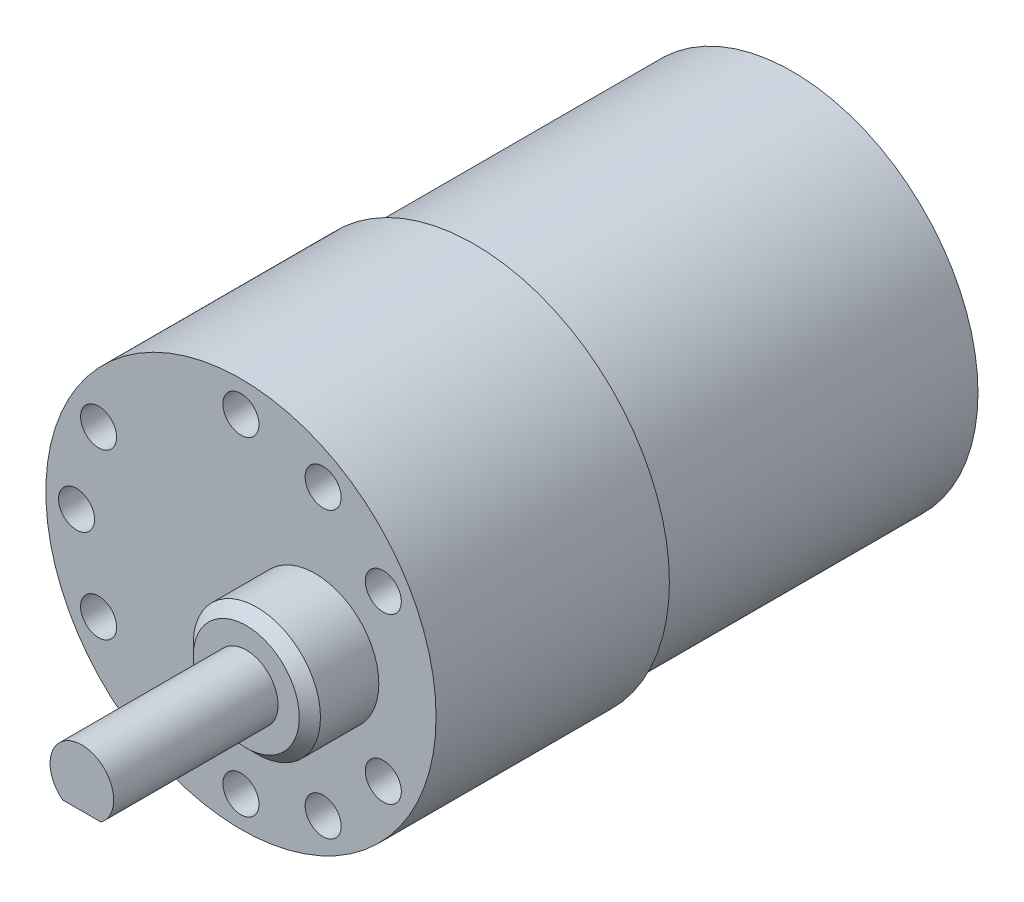
ISO-10303-21;
HEADER;
FILE_DESCRIPTION(('STEP AP214'),'2;1');
FILE_NAME('part.step','',(''),(''),'','','');
FILE_SCHEMA(('AUTOMOTIVE_DESIGN { 1 0 10303 214 1 1 1 1 }'));
ENDSEC;
DATA;
#1=APPLICATION_CONTEXT('core data for automotive mechanical design processes');
#2=APPLICATION_PROTOCOL_DEFINITION('international standard','automotive_design',2000,#1);
#3=PRODUCT_CONTEXT('',#1,'mechanical');
#4=PRODUCT('Part','Part','',(#3));
#5=PRODUCT_RELATED_PRODUCT_CATEGORY('part','',(#4));
#6=PRODUCT_DEFINITION_FORMATION('','',#4);
#7=PRODUCT_DEFINITION_CONTEXT('part definition',#1,'design');
#8=PRODUCT_DEFINITION('design','',#6,#7);
#9=PRODUCT_DEFINITION_SHAPE('','',#8);
#10=(LENGTH_UNIT() NAMED_UNIT(*) SI_UNIT(.MILLI.,.METRE.));
#11=(NAMED_UNIT(*) PLANE_ANGLE_UNIT() SI_UNIT($,.RADIAN.));
#12=(NAMED_UNIT(*) SI_UNIT($,.STERADIAN.) SOLID_ANGLE_UNIT());
#13=UNCERTAINTY_MEASURE_WITH_UNIT(LENGTH_MEASURE(1.E-05),#10,'distance_accuracy_value','');
#14=(GEOMETRIC_REPRESENTATION_CONTEXT(3) GLOBAL_UNCERTAINTY_ASSIGNED_CONTEXT((#13)) GLOBAL_UNIT_ASSIGNED_CONTEXT((#10,
#11,#12)) REPRESENTATION_CONTEXT('',''));
#15=CARTESIAN_POINT('',(0.,0.,0.));
#16=DIRECTION('',(0.,0.,1.));
#17=DIRECTION('',(1.,0.,0.));
#18=AXIS2_PLACEMENT_3D('',#15,#16,#17);
#19=CARTESIAN_POINT('',(7.,0.,28.5));
#20=DIRECTION('',(0.,0.,1.));
#21=DIRECTION('',(1.,0.,0.));
#22=AXIS2_PLACEMENT_3D('',#19,#20,#21);
#23=PLANE('',#22);
#24=CARTESIAN_POINT('',(7.,0.,28.5));
#25=DIRECTION('',(0.,0.,1.));
#26=DIRECTION('',(1.,0.,0.));
#27=AXIS2_PLACEMENT_3D('',#24,#25,#26);
#28=CIRCLE('',#27,5.00000000000005);
#29=CARTESIAN_POINT('',(12.0000000000001,0.,28.5));
#30=VERTEX_POINT('',#29);
#31=EDGE_CURVE('E43',#30,#30,#28,.T.);
#32=ORIENTED_EDGE('',*,*,#31,.T.);
#33=EDGE_LOOP('',(#32));
#34=FACE_BOUND('',#33,.T.);
#35=CARTESIAN_POINT('',(7.,0.,28.5));
#36=DIRECTION('',(0.,0.,1.));
#37=DIRECTION('',(1.,0.,0.));
#38=AXIS2_PLACEMENT_3D('',#35,#36,#37);
#39=CIRCLE('',#38,3.);
#40=CARTESIAN_POINT('',(10.,0.,28.5));
#41=VERTEX_POINT('',#40);
#42=EDGE_CURVE('E69',#41,#41,#39,.T.);
#43=ORIENTED_EDGE('',*,*,#42,.F.);
#44=EDGE_LOOP('',(#43));
#45=FACE_BOUND('',#44,.T.);
#46=ADVANCED_FACE('F34',(#34,#45),#23,.T.);
#47=CARTESIAN_POINT('',(0.,0.,22.));
#48=DIRECTION('',(0.,0.,1.));
#49=DIRECTION('',(1.,0.,0.));
#50=AXIS2_PLACEMENT_3D('',#47,#48,#49);
#51=PLANE('',#50);
#52=CARTESIAN_POINT('',(7.74999999999987,-13.4233937586589,22.));
#53=DIRECTION('',(0.,0.,1.));
#54=DIRECTION('',(1.,0.,0.));
#55=AXIS2_PLACEMENT_3D('',#52,#53,#54);
#56=CIRCLE('',#55,1.7);
#57=CARTESIAN_POINT('',(9.44999999999987,-13.4233937586589,22.));
#58=VERTEX_POINT('',#57);
#59=EDGE_CURVE('E408',#58,#58,#56,.T.);
#60=ORIENTED_EDGE('',*,*,#59,.F.);
#61=EDGE_LOOP('',(#60));
#62=FACE_BOUND('',#61,.T.);
#63=CARTESIAN_POINT('',(7.75000000000006,13.4233937586588,22.));
#64=DIRECTION('',(0.,0.,1.));
#65=DIRECTION('',(1.,0.,0.));
#66=AXIS2_PLACEMENT_3D('',#63,#64,#65);
#67=CIRCLE('',#66,1.7);
#68=CARTESIAN_POINT('',(9.45000000000006,13.4233937586588,22.));
#69=VERTEX_POINT('',#68);
#70=EDGE_CURVE('E407',#69,#69,#67,.T.);
#71=ORIENTED_EDGE('',*,*,#70,.F.);
#72=EDGE_LOOP('',(#71));
#73=FACE_BOUND('',#72,.T.);
#74=CARTESIAN_POINT('',(-13.4233937586585,7.74999999999942,22.));
#75=DIRECTION('',(0.,0.,1.));
#76=DIRECTION('',(1.,0.,0.));
#77=AXIS2_PLACEMENT_3D('',#74,#75,#76);
#78=CIRCLE('',#77,1.70000000000067);
#79=CARTESIAN_POINT('',(-11.7233937586578,7.74999999999942,22.));
#80=VERTEX_POINT('',#79);
#81=EDGE_CURVE('E417',#80,#80,#78,.T.);
#82=ORIENTED_EDGE('',*,*,#81,.F.);
#83=EDGE_LOOP('',(#82));
#84=FACE_BOUND('',#83,.T.);
#85=CARTESIAN_POINT('',(-13.4233937586578,-7.75000000000058,22.));
#86=DIRECTION('',(0.,0.,1.));
#87=DIRECTION('',(1.,0.,0.));
#88=AXIS2_PLACEMENT_3D('',#85,#86,#87);
#89=CIRCLE('',#88,1.70000000000126);
#90=CARTESIAN_POINT('',(-11.7233937586566,-7.75000000000058,22.));
#91=VERTEX_POINT('',#90);
#92=EDGE_CURVE('E422',#91,#91,#89,.T.);
#93=ORIENTED_EDGE('',*,*,#92,.F.);
#94=EDGE_LOOP('',(#93));
#95=FACE_BOUND('',#94,.T.);
#96=CARTESIAN_POINT('',(1.31781308343643E-12,-15.5,22.));
#97=DIRECTION('',(0.,0.,1.));
#98=DIRECTION('',(1.,0.,0.));
#99=AXIS2_PLACEMENT_3D('',#96,#97,#98);
#100=CIRCLE('',#99,1.70000000000136);
#101=CARTESIAN_POINT('',(1.70000000000268,-15.5,22.));
#102=VERTEX_POINT('',#101);
#103=EDGE_CURVE('E428',#102,#102,#100,.T.);
#104=ORIENTED_EDGE('',*,*,#103,.F.);
#105=EDGE_LOOP('',(#104));
#106=FACE_BOUND('',#105,.T.);
#107=CARTESIAN_POINT('',(13.4233937586598,-7.74999999999943,22.));
#108=DIRECTION('',(0.,0.,1.));
#109=DIRECTION('',(1.,0.,0.));
#110=AXIS2_PLACEMENT_3D('',#107,#108,#109);
#111=CIRCLE('',#110,1.70000000000085);
#112=CARTESIAN_POINT('',(15.1233937586606,-7.74999999999943,22.));
#113=VERTEX_POINT('',#112);
#114=EDGE_CURVE('E434',#113,#113,#111,.T.);
#115=ORIENTED_EDGE('',*,*,#114,.F.);
#116=EDGE_LOOP('',(#115));
#117=FACE_BOUND('',#116,.T.);
#118=CARTESIAN_POINT('',(13.4233937586591,7.75000000000057,22.));
#119=DIRECTION('',(0.,0.,1.));
#120=DIRECTION('',(1.,0.,0.));
#121=AXIS2_PLACEMENT_3D('',#118,#119,#120);
#122=CIRCLE('',#121,1.70000000000019);
#123=CARTESIAN_POINT('',(15.1233937586593,7.75000000000057,22.));
#124=VERTEX_POINT('',#123);
#125=EDGE_CURVE('E440',#124,#124,#122,.T.);
#126=ORIENTED_EDGE('',*,*,#125,.F.);
#127=EDGE_LOOP('',(#126));
#128=FACE_BOUND('',#127,.T.);
#129=CARTESIAN_POINT('',(-15.5,0.,22.));
#130=DIRECTION('',(0.,0.,1.));
#131=DIRECTION('',(1.,0.,0.));
#132=AXIS2_PLACEMENT_3D('',#129,#130,#131);
#133=CIRCLE('',#132,1.7);
#134=CARTESIAN_POINT('',(-13.8,0.,22.));
#135=VERTEX_POINT('',#134);
#136=EDGE_CURVE('E446',#135,#135,#133,.T.);
#137=ORIENTED_EDGE('',*,*,#136,.F.);
#138=EDGE_LOOP('',(#137));
#139=FACE_BOUND('',#138,.T.);
#140=CARTESIAN_POINT('',(0.,15.5,22.));
#141=DIRECTION('',(0.,0.,1.));
#142=DIRECTION('',(1.,0.,0.));
#143=AXIS2_PLACEMENT_3D('',#140,#141,#142);
#144=CIRCLE('',#143,1.7);
#145=CARTESIAN_POINT('',(1.7,15.5,22.));
#146=VERTEX_POINT('',#145);
#147=EDGE_CURVE('E452',#146,#146,#144,.T.);
#148=ORIENTED_EDGE('',*,*,#147,.F.);
#149=EDGE_LOOP('',(#148));
#150=FACE_BOUND('',#149,.T.);
#151=CARTESIAN_POINT('',(0.,0.,22.));
#152=DIRECTION('',(0.,0.,1.));
#153=DIRECTION('',(1.,0.,0.));
#154=AXIS2_PLACEMENT_3D('',#151,#152,#153);
#155=CIRCLE('',#154,18.4);
#156=CARTESIAN_POINT('',(18.4,0.,22.));
#157=VERTEX_POINT('',#156);
#158=EDGE_CURVE('E99',#157,#157,#155,.T.);
#159=ORIENTED_EDGE('',*,*,#158,.T.);
#160=EDGE_LOOP('',(#159));
#161=FACE_BOUND('',#160,.T.);
#162=CARTESIAN_POINT('',(7.,0.,22.));
#163=DIRECTION('',(0.,0.,1.));
#164=DIRECTION('',(1.,0.,0.));
#165=AXIS2_PLACEMENT_3D('',#162,#163,#164);
#166=CIRCLE('',#165,6.);
#167=CARTESIAN_POINT('',(13.,0.,22.));
#168=VERTEX_POINT('',#167);
#169=EDGE_CURVE('E68',#168,#168,#166,.T.);
#170=ORIENTED_EDGE('',*,*,#169,.F.);
#171=EDGE_LOOP('',(#170));
#172=FACE_BOUND('',#171,.T.);
#173=ADVANCED_FACE('F125',(#62,#73,#84,#95,#106,#117,#128,#139,#150,#161,#172),#51,.T.);
#174=CARTESIAN_POINT('',(0.,0.,0.));
#175=DIRECTION('',(0.,0.,1.));
#176=DIRECTION('',(1.,0.,0.));
#177=AXIS2_PLACEMENT_3D('',#174,#175,#176);
#178=PLANE('',#177);
#179=CARTESIAN_POINT('',(0.,0.,0.));
#180=DIRECTION('',(0.,0.,1.));
#181=DIRECTION('',(1.,0.,0.));
#182=AXIS2_PLACEMENT_3D('',#179,#180,#181);
#183=CIRCLE('',#182,18.4);
#184=CARTESIAN_POINT('',(18.4,0.,0.));
#185=VERTEX_POINT('',#184);
#186=EDGE_CURVE('E98',#185,#185,#183,.T.);
#187=ORIENTED_EDGE('',*,*,#186,.F.);
#188=EDGE_LOOP('',(#187));
#189=FACE_BOUND('',#188,.T.);
#190=CARTESIAN_POINT('',(0.,0.,0.));
#191=DIRECTION('',(0.,0.,1.));
#192=DIRECTION('',(1.,0.,0.));
#193=AXIS2_PLACEMENT_3D('',#190,#191,#192);
#194=CIRCLE('',#193,17.5);
#195=CARTESIAN_POINT('',(17.5,0.,0.));
#196=VERTEX_POINT('',#195);
#197=EDGE_CURVE('E102',#196,#196,#194,.F.);
#198=ORIENTED_EDGE('',*,*,#197,.F.);
#199=EDGE_LOOP('',(#198));
#200=FACE_BOUND('',#199,.T.);
#201=ADVANCED_FACE('F130',(#189,#200),#178,.F.);
#202=CARTESIAN_POINT('',(0.,0.,22.));
#203=DIRECTION('',(0.,0.,-1.));
#204=DIRECTION('',(-1.,0.,0.));
#205=AXIS2_PLACEMENT_3D('',#202,#203,#204);
#206=CYLINDRICAL_SURFACE('',#205,18.4);
#207=ORIENTED_EDGE('',*,*,#158,.F.);
#208=EDGE_LOOP('',(#207));
#209=FACE_BOUND('',#208,.T.);
#210=ORIENTED_EDGE('',*,*,#186,.T.);
#211=EDGE_LOOP('',(#210));
#212=FACE_BOUND('',#211,.T.);
#213=ADVANCED_FACE('F140',(#209,#212),#206,.T.);
#214=CARTESIAN_POINT('',(0.,0.,-30.));
#215=DIRECTION('',(0.,0.,1.));
#216=DIRECTION('',(1.,0.,0.));
#217=AXIS2_PLACEMENT_3D('',#214,#215,#216);
#218=CYLINDRICAL_SURFACE('',#217,17.5);
#219=CARTESIAN_POINT('',(0.,0.,-30.));
#220=DIRECTION('',(0.,0.,-1.));
#221=DIRECTION('',(-1.,0.,0.));
#222=AXIS2_PLACEMENT_3D('',#219,#220,#221);
#223=CIRCLE('',#222,17.5);
#224=CARTESIAN_POINT('',(-17.5,0.,-30.));
#225=VERTEX_POINT('',#224);
#226=EDGE_CURVE('E95',#225,#225,#223,.T.);
#227=ORIENTED_EDGE('',*,*,#226,.F.);
#228=EDGE_LOOP('',(#227));
#229=FACE_BOUND('',#228,.T.);
#230=ORIENTED_EDGE('',*,*,#197,.T.);
#231=EDGE_LOOP('',(#230));
#232=FACE_BOUND('',#231,.T.);
#233=ADVANCED_FACE('F137',(#229,#232),#218,.T.);
#234=CARTESIAN_POINT('',(0.,0.,-30.));
#235=DIRECTION('',(0.,0.,-1.));
#236=DIRECTION('',(-1.,0.,0.));
#237=AXIS2_PLACEMENT_3D('',#234,#235,#236);
#238=PLANE('',#237);
#239=ORIENTED_EDGE('',*,*,#226,.T.);
#240=EDGE_LOOP('',(#239));
#241=FACE_BOUND('',#240,.T.);
#242=ADVANCED_FACE('F120',(#241),#238,.T.);
#243=CARTESIAN_POINT('',(7.,0.,28.5));
#244=DIRECTION('',(0.,0.,-1.));
#245=DIRECTION('',(-1.,0.,0.));
#246=AXIS2_PLACEMENT_3D('',#243,#244,#245);
#247=CYLINDRICAL_SURFACE('',#246,6.);
#248=CARTESIAN_POINT('',(7.,0.,27.5));
#249=DIRECTION('',(0.,0.,1.));
#250=DIRECTION('',(1.,0.,0.));
#251=AXIS2_PLACEMENT_3D('',#248,#249,#250);
#252=CIRCLE('',#251,6.);
#253=CARTESIAN_POINT('',(13.,0.,27.5));
#254=VERTEX_POINT('',#253);
#255=EDGE_CURVE('E11',#254,#254,#252,.F.);
#256=ORIENTED_EDGE('',*,*,#255,.T.);
#257=EDGE_LOOP('',(#256));
#258=FACE_BOUND('',#257,.T.);
#259=ORIENTED_EDGE('',*,*,#169,.T.);
#260=EDGE_LOOP('',(#259));
#261=FACE_BOUND('',#260,.T.);
#262=ADVANCED_FACE('F113',(#258,#261),#247,.T.);
#263=CARTESIAN_POINT('',(7.,0.,28.5));
#264=DIRECTION('',(0.,0.,-1.));
#265=DIRECTION('',(-1.,0.,0.));
#266=AXIS2_PLACEMENT_3D('',#263,#264,#265);
#267=CONICAL_SURFACE('',#266,5.00000000000005,0.785398163397445);
#268=ORIENTED_EDGE('',*,*,#255,.F.);
#269=EDGE_LOOP('',(#268));
#270=FACE_BOUND('',#269,.T.);
#271=ORIENTED_EDGE('',*,*,#31,.F.);
#272=EDGE_LOOP('',(#271));
#273=FACE_BOUND('',#272,.T.);
#274=ADVANCED_FACE('F36',(#270,#273),#267,.T.);
#275=CARTESIAN_POINT('',(7.,0.,32.));
#276=DIRECTION('',(0.,0.,-1.));
#277=DIRECTION('',(-1.,0.,0.));
#278=AXIS2_PLACEMENT_3D('',#275,#276,#277);
#279=CYLINDRICAL_SURFACE('',#278,3.);
#280=CARTESIAN_POINT('',(7.,0.,32.));
#281=DIRECTION('',(0.,0.,1.));
#282=DIRECTION('',(1.,0.,0.));
#283=AXIS2_PLACEMENT_3D('',#280,#281,#282);
#284=CIRCLE('',#283,3.);
#285=CARTESIAN_POINT('',(5.2,-2.4,32.));
#286=VERTEX_POINT('',#285);
#287=CARTESIAN_POINT('',(8.8,-2.4,32.));
#288=VERTEX_POINT('',#287);
#289=EDGE_CURVE('E62',#286,#288,#284,.T.);
#290=ORIENTED_EDGE('',*,*,#289,.F.);
#291=DIRECTION('',(0.,0.,-1.));
#292=VECTOR('',#291,1.);
#293=CARTESIAN_POINT('',(5.2,-2.4,44.));
#294=LINE('',#293,#292);
#295=CARTESIAN_POINT('',(5.2,-2.4,44.));
#296=VERTEX_POINT('',#295);
#297=EDGE_CURVE('E75',#296,#286,#294,.T.);
#298=ORIENTED_EDGE('',*,*,#297,.F.);
#299=CARTESIAN_POINT('',(7.,0.,44.));
#300=DIRECTION('',(0.,0.,1.));
#301=DIRECTION('',(1.,0.,0.));
#302=AXIS2_PLACEMENT_3D('',#299,#300,#301);
#303=CIRCLE('',#302,3.);
#304=CARTESIAN_POINT('',(8.8,-2.4,44.));
#305=VERTEX_POINT('',#304);
#306=EDGE_CURVE('E76',#305,#296,#303,.T.);
#307=ORIENTED_EDGE('',*,*,#306,.F.);
#308=DIRECTION('',(0.,0.,-1.));
#309=VECTOR('',#308,1.);
#310=CARTESIAN_POINT('',(8.8,-2.4,44.));
#311=LINE('',#310,#309);
#312=EDGE_CURVE('E73',#305,#288,#311,.T.);
#313=ORIENTED_EDGE('',*,*,#312,.T.);
#314=EDGE_LOOP('',(#290,#298,#307,#313));
#315=FACE_BOUND('',#314,.T.);
#316=ORIENTED_EDGE('',*,*,#42,.T.);
#317=EDGE_LOOP('',(#316));
#318=FACE_BOUND('',#317,.T.);
#319=ADVANCED_FACE('F79',(#315,#318),#279,.T.);
#320=CARTESIAN_POINT('',(7.,0.,32.));
#321=DIRECTION('',(0.,0.,1.));
#322=DIRECTION('',(1.,0.,0.));
#323=AXIS2_PLACEMENT_3D('',#320,#321,#322);
#324=PLANE('',#323);
#325=DIRECTION('',(1.,0.,0.));
#326=VECTOR('',#325,1.);
#327=CARTESIAN_POINT('',(0.,-2.4,32.));
#328=LINE('',#327,#326);
#329=EDGE_CURVE('E50',#286,#288,#328,.T.);
#330=ORIENTED_EDGE('',*,*,#329,.F.);
#331=ORIENTED_EDGE('',*,*,#289,.T.);
#332=EDGE_LOOP('',(#330,#331));
#333=FACE_BOUND('',#332,.T.);
#334=ADVANCED_FACE('F63',(#333),#324,.T.);
#335=CARTESIAN_POINT('',(0.,-2.4,44.));
#336=DIRECTION('',(0.,1.,0.));
#337=DIRECTION('',(0.,0.,1.));
#338=AXIS2_PLACEMENT_3D('',#335,#336,#337);
#339=PLANE('',#338);
#340=ORIENTED_EDGE('',*,*,#329,.T.);
#341=ORIENTED_EDGE('',*,*,#312,.F.);
#342=DIRECTION('',(1.,0.,0.));
#343=VECTOR('',#342,1.);
#344=CARTESIAN_POINT('',(0.,-2.4,44.));
#345=LINE('',#344,#343);
#346=EDGE_CURVE('E58',#296,#305,#345,.T.);
#347=ORIENTED_EDGE('',*,*,#346,.F.);
#348=ORIENTED_EDGE('',*,*,#297,.T.);
#349=EDGE_LOOP('',(#340,#341,#347,#348));
#350=FACE_BOUND('',#349,.T.);
#351=ADVANCED_FACE('F72',(#350),#339,.F.);
#352=CARTESIAN_POINT('',(0.,0.,44.));
#353=DIRECTION('',(0.,0.,1.));
#354=DIRECTION('',(1.,0.,0.));
#355=AXIS2_PLACEMENT_3D('',#352,#353,#354);
#356=PLANE('',#355);
#357=ORIENTED_EDGE('',*,*,#306,.T.);
#358=ORIENTED_EDGE('',*,*,#346,.T.);
#359=EDGE_LOOP('',(#357,#358));
#360=FACE_BOUND('',#359,.T.);
#361=ADVANCED_FACE('F207',(#360),#356,.T.);
#362=CARTESIAN_POINT('',(0.,15.5,10.));
#363=DIRECTION('',(0.,0.,1.));
#364=DIRECTION('',(1.,0.,0.));
#365=AXIS2_PLACEMENT_3D('',#362,#363,#364);
#366=CYLINDRICAL_SURFACE('',#365,1.7);
#367=CARTESIAN_POINT('',(0.,15.5,10.));
#368=DIRECTION('',(0.,0.,1.));
#369=DIRECTION('',(1.,0.,0.));
#370=AXIS2_PLACEMENT_3D('',#367,#368,#369);
#371=CIRCLE('',#370,1.7);
#372=CARTESIAN_POINT('',(1.7,15.5,10.));
#373=VERTEX_POINT('',#372);
#374=EDGE_CURVE('E77',#373,#373,#371,.T.);
#375=ORIENTED_EDGE('',*,*,#374,.F.);
#376=EDGE_LOOP('',(#375));
#377=FACE_BOUND('',#376,.T.);
#378=ORIENTED_EDGE('',*,*,#147,.T.);
#379=EDGE_LOOP('',(#378));
#380=FACE_BOUND('',#379,.T.);
#381=ADVANCED_FACE('F216',(#377,#380),#366,.F.);
#382=CARTESIAN_POINT('',(0.,15.5,10.));
#383=DIRECTION('',(0.,0.,1.));
#384=DIRECTION('',(1.,0.,0.));
#385=AXIS2_PLACEMENT_3D('',#382,#383,#384);
#386=PLANE('',#385);
#387=ORIENTED_EDGE('',*,*,#374,.T.);
#388=EDGE_LOOP('',(#387));
#389=FACE_BOUND('',#388,.T.);
#390=ADVANCED_FACE('F230',(#389),#386,.T.);
#391=CARTESIAN_POINT('',(-15.5,0.,10.));
#392=DIRECTION('',(0.,0.,1.));
#393=DIRECTION('',(1.,0.,0.));
#394=AXIS2_PLACEMENT_3D('',#391,#392,#393);
#395=CYLINDRICAL_SURFACE('',#394,1.7);
#396=CARTESIAN_POINT('',(-15.5,0.,10.));
#397=DIRECTION('',(0.,0.,1.));
#398=DIRECTION('',(1.,0.,0.));
#399=AXIS2_PLACEMENT_3D('',#396,#397,#398);
#400=CIRCLE('',#399,1.7);
#401=CARTESIAN_POINT('',(-13.8,0.,10.));
#402=VERTEX_POINT('',#401);
#403=EDGE_CURVE('E449',#402,#402,#400,.T.);
#404=ORIENTED_EDGE('',*,*,#403,.F.);
#405=EDGE_LOOP('',(#404));
#406=FACE_BOUND('',#405,.T.);
#407=ORIENTED_EDGE('',*,*,#136,.T.);
#408=EDGE_LOOP('',(#407));
#409=FACE_BOUND('',#408,.T.);
#410=ADVANCED_FACE('F240',(#406,#409),#395,.F.);
#411=CARTESIAN_POINT('',(-15.5,0.,10.));
#412=DIRECTION('',(0.,0.,1.));
#413=DIRECTION('',(1.,0.,0.));
#414=AXIS2_PLACEMENT_3D('',#411,#412,#413);
#415=PLANE('',#414);
#416=ORIENTED_EDGE('',*,*,#403,.T.);
#417=EDGE_LOOP('',(#416));
#418=FACE_BOUND('',#417,.T.);
#419=ADVANCED_FACE('F250',(#418),#415,.T.);
#420=CARTESIAN_POINT('',(13.4233937586591,7.75000000000057,10.));
#421=DIRECTION('',(0.,0.,1.));
#422=DIRECTION('',(1.,0.,0.));
#423=AXIS2_PLACEMENT_3D('',#420,#421,#422);
#424=CYLINDRICAL_SURFACE('',#423,1.70000000000019);
#425=CARTESIAN_POINT('',(13.4233937586591,7.75000000000057,10.));
#426=DIRECTION('',(0.,0.,1.));
#427=DIRECTION('',(1.,0.,0.));
#428=AXIS2_PLACEMENT_3D('',#425,#426,#427);
#429=CIRCLE('',#428,1.70000000000019);
#430=CARTESIAN_POINT('',(15.1233937586593,7.75000000000057,10.));
#431=VERTEX_POINT('',#430);
#432=EDGE_CURVE('E443',#431,#431,#429,.T.);
#433=ORIENTED_EDGE('',*,*,#432,.F.);
#434=EDGE_LOOP('',(#433));
#435=FACE_BOUND('',#434,.T.);
#436=ORIENTED_EDGE('',*,*,#125,.T.);
#437=EDGE_LOOP('',(#436));
#438=FACE_BOUND('',#437,.T.);
#439=ADVANCED_FACE('F260',(#435,#438),#424,.F.);
#440=CARTESIAN_POINT('',(13.4233937586591,7.75000000000057,10.));
#441=DIRECTION('',(0.,0.,1.));
#442=DIRECTION('',(1.,0.,0.));
#443=AXIS2_PLACEMENT_3D('',#440,#441,#442);
#444=PLANE('',#443);
#445=ORIENTED_EDGE('',*,*,#432,.T.);
#446=EDGE_LOOP('',(#445));
#447=FACE_BOUND('',#446,.T.);
#448=ADVANCED_FACE('F270',(#447),#444,.T.);
#449=CARTESIAN_POINT('',(13.4233937586598,-7.74999999999943,10.));
#450=DIRECTION('',(0.,0.,1.));
#451=DIRECTION('',(1.,0.,0.));
#452=AXIS2_PLACEMENT_3D('',#449,#450,#451);
#453=CYLINDRICAL_SURFACE('',#452,1.70000000000085);
#454=CARTESIAN_POINT('',(13.4233937586598,-7.74999999999943,10.));
#455=DIRECTION('',(0.,0.,1.));
#456=DIRECTION('',(1.,0.,0.));
#457=AXIS2_PLACEMENT_3D('',#454,#455,#456);
#458=CIRCLE('',#457,1.70000000000085);
#459=CARTESIAN_POINT('',(15.1233937586606,-7.74999999999943,10.));
#460=VERTEX_POINT('',#459);
#461=EDGE_CURVE('E437',#460,#460,#458,.T.);
#462=ORIENTED_EDGE('',*,*,#461,.F.);
#463=EDGE_LOOP('',(#462));
#464=FACE_BOUND('',#463,.T.);
#465=ORIENTED_EDGE('',*,*,#114,.T.);
#466=EDGE_LOOP('',(#465));
#467=FACE_BOUND('',#466,.T.);
#468=ADVANCED_FACE('F280',(#464,#467),#453,.F.);
#469=CARTESIAN_POINT('',(13.4233937586598,-7.74999999999943,10.));
#470=DIRECTION('',(0.,0.,1.));
#471=DIRECTION('',(1.,0.,0.));
#472=AXIS2_PLACEMENT_3D('',#469,#470,#471);
#473=PLANE('',#472);
#474=ORIENTED_EDGE('',*,*,#461,.T.);
#475=EDGE_LOOP('',(#474));
#476=FACE_BOUND('',#475,.T.);
#477=ADVANCED_FACE('F290',(#476),#473,.T.);
#478=CARTESIAN_POINT('',(1.31781308343643E-12,-15.5,10.));
#479=DIRECTION('',(0.,0.,1.));
#480=DIRECTION('',(1.,0.,0.));
#481=AXIS2_PLACEMENT_3D('',#478,#479,#480);
#482=CYLINDRICAL_SURFACE('',#481,1.70000000000136);
#483=CARTESIAN_POINT('',(1.31781308343643E-12,-15.5,10.));
#484=DIRECTION('',(0.,0.,1.));
#485=DIRECTION('',(1.,0.,0.));
#486=AXIS2_PLACEMENT_3D('',#483,#484,#485);
#487=CIRCLE('',#486,1.70000000000136);
#488=CARTESIAN_POINT('',(1.70000000000268,-15.5,10.));
#489=VERTEX_POINT('',#488);
#490=EDGE_CURVE('E431',#489,#489,#487,.T.);
#491=ORIENTED_EDGE('',*,*,#490,.F.);
#492=EDGE_LOOP('',(#491));
#493=FACE_BOUND('',#492,.T.);
#494=ORIENTED_EDGE('',*,*,#103,.T.);
#495=EDGE_LOOP('',(#494));
#496=FACE_BOUND('',#495,.T.);
#497=ADVANCED_FACE('F300',(#493,#496),#482,.F.);
#498=CARTESIAN_POINT('',(1.31781308343643E-12,-15.5,10.));
#499=DIRECTION('',(0.,0.,1.));
#500=DIRECTION('',(1.,0.,0.));
#501=AXIS2_PLACEMENT_3D('',#498,#499,#500);
#502=PLANE('',#501);
#503=ORIENTED_EDGE('',*,*,#490,.T.);
#504=EDGE_LOOP('',(#503));
#505=FACE_BOUND('',#504,.T.);
#506=ADVANCED_FACE('F310',(#505),#502,.T.);
#507=CARTESIAN_POINT('',(-13.4233937586578,-7.75000000000058,10.));
#508=DIRECTION('',(0.,0.,1.));
#509=DIRECTION('',(1.,0.,0.));
#510=AXIS2_PLACEMENT_3D('',#507,#508,#509);
#511=CYLINDRICAL_SURFACE('',#510,1.70000000000126);
#512=CARTESIAN_POINT('',(-13.4233937586578,-7.75000000000058,10.));
#513=DIRECTION('',(0.,0.,1.));
#514=DIRECTION('',(1.,0.,0.));
#515=AXIS2_PLACEMENT_3D('',#512,#513,#514);
#516=CIRCLE('',#515,1.70000000000126);
#517=CARTESIAN_POINT('',(-11.7233937586566,-7.75000000000058,10.));
#518=VERTEX_POINT('',#517);
#519=EDGE_CURVE('E425',#518,#518,#516,.T.);
#520=ORIENTED_EDGE('',*,*,#519,.F.);
#521=EDGE_LOOP('',(#520));
#522=FACE_BOUND('',#521,.T.);
#523=ORIENTED_EDGE('',*,*,#92,.T.);
#524=EDGE_LOOP('',(#523));
#525=FACE_BOUND('',#524,.T.);
#526=ADVANCED_FACE('F320',(#522,#525),#511,.F.);
#527=CARTESIAN_POINT('',(-13.4233937586578,-7.75000000000058,10.));
#528=DIRECTION('',(0.,0.,1.));
#529=DIRECTION('',(1.,0.,0.));
#530=AXIS2_PLACEMENT_3D('',#527,#528,#529);
#531=PLANE('',#530);
#532=ORIENTED_EDGE('',*,*,#519,.T.);
#533=EDGE_LOOP('',(#532));
#534=FACE_BOUND('',#533,.T.);
#535=ADVANCED_FACE('F330',(#534),#531,.T.);
#536=CARTESIAN_POINT('',(-13.4233937586585,7.74999999999942,10.));
#537=DIRECTION('',(0.,0.,1.));
#538=DIRECTION('',(1.,0.,0.));
#539=AXIS2_PLACEMENT_3D('',#536,#537,#538);
#540=CYLINDRICAL_SURFACE('',#539,1.70000000000067);
#541=CARTESIAN_POINT('',(-13.4233937586585,7.74999999999942,10.));
#542=DIRECTION('',(0.,0.,1.));
#543=DIRECTION('',(1.,0.,0.));
#544=AXIS2_PLACEMENT_3D('',#541,#542,#543);
#545=CIRCLE('',#544,1.70000000000067);
#546=CARTESIAN_POINT('',(-11.7233937586578,7.74999999999942,10.));
#547=VERTEX_POINT('',#546);
#548=EDGE_CURVE('E419',#547,#547,#545,.T.);
#549=ORIENTED_EDGE('',*,*,#548,.F.);
#550=EDGE_LOOP('',(#549));
#551=FACE_BOUND('',#550,.T.);
#552=ORIENTED_EDGE('',*,*,#81,.T.);
#553=EDGE_LOOP('',(#552));
#554=FACE_BOUND('',#553,.T.);
#555=ADVANCED_FACE('F340',(#551,#554),#540,.F.);
#556=CARTESIAN_POINT('',(-13.4233937586585,7.74999999999942,10.));
#557=DIRECTION('',(0.,0.,1.));
#558=DIRECTION('',(1.,0.,0.));
#559=AXIS2_PLACEMENT_3D('',#556,#557,#558);
#560=PLANE('',#559);
#561=ORIENTED_EDGE('',*,*,#548,.T.);
#562=EDGE_LOOP('',(#561));
#563=FACE_BOUND('',#562,.T.);
#564=ADVANCED_FACE('F350',(#563),#560,.T.);
#565=CARTESIAN_POINT('',(7.75000000000006,13.4233937586588,10.));
#566=DIRECTION('',(0.,0.,1.));
#567=DIRECTION('',(1.,0.,0.));
#568=AXIS2_PLACEMENT_3D('',#565,#566,#567);
#569=CYLINDRICAL_SURFACE('',#568,1.7);
#570=CARTESIAN_POINT('',(7.75000000000006,13.4233937586588,10.));
#571=DIRECTION('',(0.,0.,1.));
#572=DIRECTION('',(1.,0.,0.));
#573=AXIS2_PLACEMENT_3D('',#570,#571,#572);
#574=CIRCLE('',#573,1.7);
#575=CARTESIAN_POINT('',(9.45000000000006,13.4233937586588,10.));
#576=VERTEX_POINT('',#575);
#577=EDGE_CURVE('E411',#576,#576,#574,.T.);
#578=ORIENTED_EDGE('',*,*,#577,.F.);
#579=EDGE_LOOP('',(#578));
#580=FACE_BOUND('',#579,.T.);
#581=ORIENTED_EDGE('',*,*,#70,.T.);
#582=EDGE_LOOP('',(#581));
#583=FACE_BOUND('',#582,.T.);
#584=ADVANCED_FACE('F360',(#580,#583),#569,.F.);
#585=CARTESIAN_POINT('',(7.75000000000006,13.4233937586588,10.));
#586=DIRECTION('',(0.,0.,1.));
#587=DIRECTION('',(1.,0.,0.));
#588=AXIS2_PLACEMENT_3D('',#585,#586,#587);
#589=PLANE('',#588);
#590=ORIENTED_EDGE('',*,*,#577,.T.);
#591=EDGE_LOOP('',(#590));
#592=FACE_BOUND('',#591,.T.);
#593=ADVANCED_FACE('F370',(#592),#589,.T.);
#594=CARTESIAN_POINT('',(7.74999999999987,-13.4233937586589,10.));
#595=DIRECTION('',(0.,0.,1.));
#596=DIRECTION('',(1.,0.,0.));
#597=AXIS2_PLACEMENT_3D('',#594,#595,#596);
#598=CYLINDRICAL_SURFACE('',#597,1.7);
#599=CARTESIAN_POINT('',(7.74999999999987,-13.4233937586589,10.));
#600=DIRECTION('',(0.,0.,1.));
#601=DIRECTION('',(1.,0.,0.));
#602=AXIS2_PLACEMENT_3D('',#599,#600,#601);
#603=CIRCLE('',#602,1.7);
#604=CARTESIAN_POINT('',(9.44999999999987,-13.4233937586589,10.));
#605=VERTEX_POINT('',#604);
#606=EDGE_CURVE('E406',#605,#605,#603,.T.);
#607=ORIENTED_EDGE('',*,*,#606,.F.);
#608=EDGE_LOOP('',(#607));
#609=FACE_BOUND('',#608,.T.);
#610=ORIENTED_EDGE('',*,*,#59,.T.);
#611=EDGE_LOOP('',(#610));
#612=FACE_BOUND('',#611,.T.);
#613=ADVANCED_FACE('F380',(#609,#612),#598,.F.);
#614=CARTESIAN_POINT('',(7.74999999999987,-13.4233937586589,10.));
#615=DIRECTION('',(0.,0.,1.));
#616=DIRECTION('',(1.,0.,0.));
#617=AXIS2_PLACEMENT_3D('',#614,#615,#616);
#618=PLANE('',#617);
#619=ORIENTED_EDGE('',*,*,#606,.T.);
#620=EDGE_LOOP('',(#619));
#621=FACE_BOUND('',#620,.T.);
#622=ADVANCED_FACE('F390',(#621),#618,.T.);
#623=CLOSED_SHELL('',(#46,#173,#201,#213,#233,#242,#262,#274,#319,#334,#351,#361,#381,#390,#410,
#419,#439,#448,#468,#477,#497,#506,#526,#535,#555,#564,#584,#593,#613,#622));
#624=MANIFOLD_SOLID_BREP('B2',#623);
#625=ADVANCED_BREP_SHAPE_REPRESENTATION('',(#18,#624),#14);
#626=SHAPE_DEFINITION_REPRESENTATION(#9,#625);
ENDSEC;
END-ISO-10303-21;
